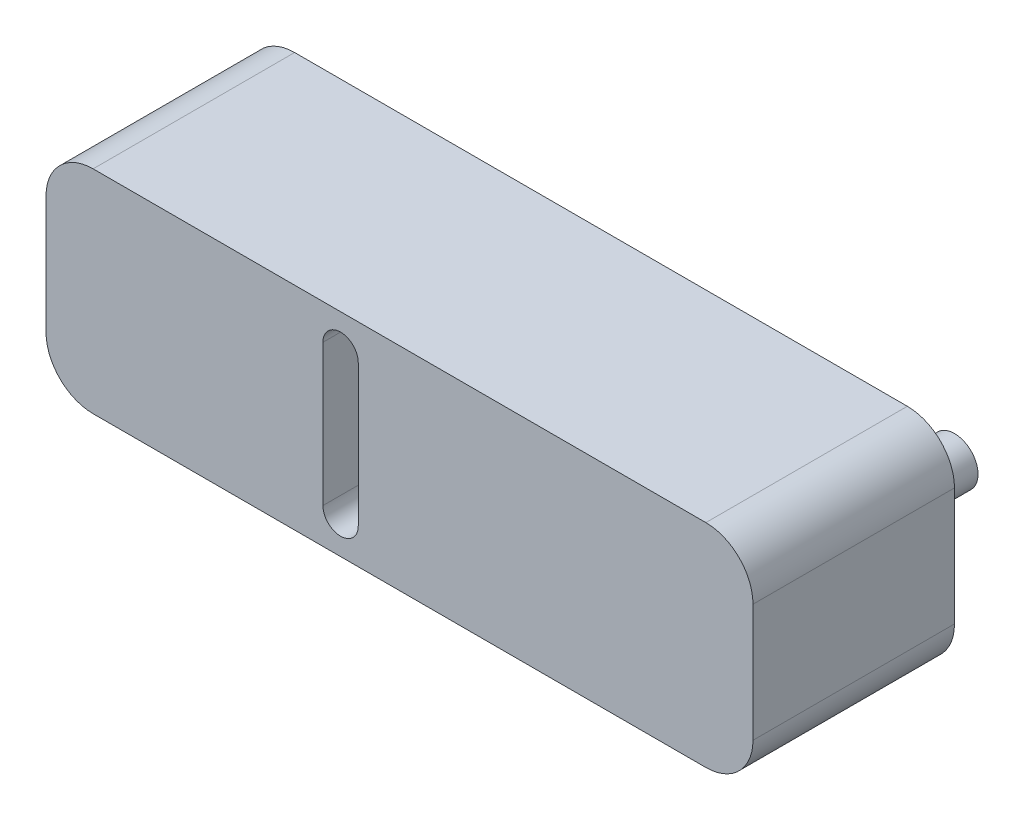
ISO-10303-21;
HEADER;
FILE_DESCRIPTION(('STEP AP214'),'2;1');
FILE_NAME('part.step','',(''),(''),'','','');
FILE_SCHEMA(('AUTOMOTIVE_DESIGN { 1 0 10303 214 1 1 1 1 }'));
ENDSEC;
DATA;
#1=APPLICATION_CONTEXT('core data for automotive mechanical design processes');
#2=APPLICATION_PROTOCOL_DEFINITION('international standard','automotive_design',2000,#1);
#3=PRODUCT_CONTEXT('',#1,'mechanical');
#4=PRODUCT('Part','Part','',(#3));
#5=PRODUCT_RELATED_PRODUCT_CATEGORY('part','',(#4));
#6=PRODUCT_DEFINITION_FORMATION('','',#4);
#7=PRODUCT_DEFINITION_CONTEXT('part definition',#1,'design');
#8=PRODUCT_DEFINITION('design','',#6,#7);
#9=PRODUCT_DEFINITION_SHAPE('','',#8);
#10=(LENGTH_UNIT() NAMED_UNIT(*) SI_UNIT(.MILLI.,.METRE.));
#11=(NAMED_UNIT(*) PLANE_ANGLE_UNIT() SI_UNIT($,.RADIAN.));
#12=(NAMED_UNIT(*) SI_UNIT($,.STERADIAN.) SOLID_ANGLE_UNIT());
#13=UNCERTAINTY_MEASURE_WITH_UNIT(LENGTH_MEASURE(1.E-05),#10,'distance_accuracy_value','');
#14=(GEOMETRIC_REPRESENTATION_CONTEXT(3) GLOBAL_UNCERTAINTY_ASSIGNED_CONTEXT((#13)) GLOBAL_UNIT_ASSIGNED_CONTEXT((#10,
#11,#12)) REPRESENTATION_CONTEXT('',''));
#15=CARTESIAN_POINT('',(0.,0.,0.));
#16=DIRECTION('',(0.,0.,1.));
#17=DIRECTION('',(1.,0.,0.));
#18=AXIS2_PLACEMENT_3D('',#15,#16,#17);
#19=CARTESIAN_POINT('',(38.1,-11.43,-21.717));
#20=DIRECTION('',(1.,0.,0.));
#21=DIRECTION('',(0.,0.,-1.));
#22=AXIS2_PLACEMENT_3D('',#19,#20,#21);
#23=PLANE('',#22);
#24=DIRECTION('',(0.,1.,0.));
#25=VECTOR('',#24,1.);
#26=CARTESIAN_POINT('',(38.1,-11.43,0.));
#27=LINE('',#26,#25);
#28=CARTESIAN_POINT('',(38.1,-6.35,0.));
#29=VERTEX_POINT('',#28);
#30=CARTESIAN_POINT('',(38.1,6.35,0.));
#31=VERTEX_POINT('',#30);
#32=EDGE_CURVE('E142',#29,#31,#27,.T.);
#33=ORIENTED_EDGE('',*,*,#32,.F.);
#34=DIRECTION('',(0.,0.,1.));
#35=VECTOR('',#34,1.);
#36=CARTESIAN_POINT('',(38.1,-6.35,-21.717));
#37=LINE('',#36,#35);
#38=CARTESIAN_POINT('',(38.1,-6.35,-21.717));
#39=VERTEX_POINT('',#38);
#40=EDGE_CURVE('E236',#29,#39,#37,.F.);
#41=ORIENTED_EDGE('',*,*,#40,.T.);
#42=DIRECTION('',(0.,1.,0.));
#43=VECTOR('',#42,1.);
#44=CARTESIAN_POINT('',(38.1,-11.43,-21.717));
#45=LINE('',#44,#43);
#46=CARTESIAN_POINT('',(38.1,6.35,-21.717));
#47=VERTEX_POINT('',#46);
#48=EDGE_CURVE('E183',#39,#47,#45,.T.);
#49=ORIENTED_EDGE('',*,*,#48,.T.);
#50=DIRECTION('',(0.,0.,1.));
#51=VECTOR('',#50,1.);
#52=CARTESIAN_POINT('',(38.1,6.35,-21.717));
#53=LINE('',#52,#51);
#54=EDGE_CURVE('E232',#47,#31,#53,.T.);
#55=ORIENTED_EDGE('',*,*,#54,.T.);
#56=EDGE_LOOP('',(#33,#41,#49,#55));
#57=FACE_BOUND('',#56,.T.);
#58=ADVANCED_FACE('F39',(#57),#23,.T.);
#59=CARTESIAN_POINT('',(-38.1,-11.43,-21.717));
#60=DIRECTION('',(0.,-1.,0.));
#61=DIRECTION('',(0.,0.,-1.));
#62=AXIS2_PLACEMENT_3D('',#59,#60,#61);
#63=PLANE('',#62);
#64=DIRECTION('',(1.,0.,0.));
#65=VECTOR('',#64,1.);
#66=CARTESIAN_POINT('',(-38.1,-11.43,-21.717));
#67=LINE('',#66,#65);
#68=CARTESIAN_POINT('',(-33.02,-11.43,-21.717));
#69=VERTEX_POINT('',#68);
#70=CARTESIAN_POINT('',(33.02,-11.43,-21.717));
#71=VERTEX_POINT('',#70);
#72=EDGE_CURVE('E195',#69,#71,#67,.T.);
#73=ORIENTED_EDGE('',*,*,#72,.T.);
#74=DIRECTION('',(0.,0.,1.));
#75=VECTOR('',#74,1.);
#76=CARTESIAN_POINT('',(33.02,-11.43,-21.717));
#77=LINE('',#76,#75);
#78=CARTESIAN_POINT('',(33.02,-11.43,0.));
#79=VERTEX_POINT('',#78);
#80=EDGE_CURVE('E216',#71,#79,#77,.T.);
#81=ORIENTED_EDGE('',*,*,#80,.T.);
#82=DIRECTION('',(1.,0.,0.));
#83=VECTOR('',#82,1.);
#84=CARTESIAN_POINT('',(-38.1,-11.43,0.));
#85=LINE('',#84,#83);
#86=CARTESIAN_POINT('',(-33.02,-11.43,0.));
#87=VERTEX_POINT('',#86);
#88=EDGE_CURVE('E188',#87,#79,#85,.T.);
#89=ORIENTED_EDGE('',*,*,#88,.F.);
#90=DIRECTION('',(0.,0.,1.));
#91=VECTOR('',#90,1.);
#92=CARTESIAN_POINT('',(-33.02,-11.43,-21.717));
#93=LINE('',#92,#91);
#94=EDGE_CURVE('E199',#87,#69,#93,.F.);
#95=ORIENTED_EDGE('',*,*,#94,.T.);
#96=EDGE_LOOP('',(#73,#81,#89,#95));
#97=FACE_BOUND('',#96,.T.);
#98=ADVANCED_FACE('F283',(#97),#63,.T.);
#99=CARTESIAN_POINT('',(-38.1,-11.43,-21.717));
#100=DIRECTION('',(-1.,0.,0.));
#101=DIRECTION('',(0.,0.,1.));
#102=AXIS2_PLACEMENT_3D('',#99,#100,#101);
#103=PLANE('',#102);
#104=DIRECTION('',(0.,-1.,0.));
#105=VECTOR('',#104,1.);
#106=CARTESIAN_POINT('',(-38.1,-11.43,-21.717));
#107=LINE('',#106,#105);
#108=CARTESIAN_POINT('',(-38.1,6.35,-21.717));
#109=VERTEX_POINT('',#108);
#110=CARTESIAN_POINT('',(-38.1,-6.35,-21.717));
#111=VERTEX_POINT('',#110);
#112=EDGE_CURVE('E191',#109,#111,#107,.T.);
#113=ORIENTED_EDGE('',*,*,#112,.T.);
#114=DIRECTION('',(0.,0.,1.));
#115=VECTOR('',#114,1.);
#116=CARTESIAN_POINT('',(-38.1,-6.35,-21.717));
#117=LINE('',#116,#115);
#118=CARTESIAN_POINT('',(-38.1,-6.35,0.));
#119=VERTEX_POINT('',#118);
#120=EDGE_CURVE('E253',#111,#119,#117,.T.);
#121=ORIENTED_EDGE('',*,*,#120,.T.);
#122=DIRECTION('',(0.,-1.,0.));
#123=VECTOR('',#122,1.);
#124=CARTESIAN_POINT('',(-38.1,-11.43,0.));
#125=LINE('',#124,#123);
#126=CARTESIAN_POINT('',(-38.1,6.35,0.));
#127=VERTEX_POINT('',#126);
#128=EDGE_CURVE('E207',#127,#119,#125,.T.);
#129=ORIENTED_EDGE('',*,*,#128,.F.);
#130=DIRECTION('',(0.,0.,1.));
#131=VECTOR('',#130,1.);
#132=CARTESIAN_POINT('',(-38.1,6.35,-21.717));
#133=LINE('',#132,#131);
#134=EDGE_CURVE('E250',#127,#109,#133,.F.);
#135=ORIENTED_EDGE('',*,*,#134,.T.);
#136=EDGE_LOOP('',(#113,#121,#129,#135));
#137=FACE_BOUND('',#136,.T.);
#138=ADVANCED_FACE('F260',(#137),#103,.T.);
#139=CARTESIAN_POINT('',(-38.1,11.43,-21.717));
#140=DIRECTION('',(0.,1.,0.));
#141=DIRECTION('',(0.,0.,1.));
#142=AXIS2_PLACEMENT_3D('',#139,#140,#141);
#143=PLANE('',#142);
#144=DIRECTION('',(-1.,0.,0.));
#145=VECTOR('',#144,1.);
#146=CARTESIAN_POINT('',(-38.1,11.43,-21.717));
#147=LINE('',#146,#145);
#148=CARTESIAN_POINT('',(33.02,11.43,-21.717));
#149=VERTEX_POINT('',#148);
#150=CARTESIAN_POINT('',(-33.02,11.43,-21.717));
#151=VERTEX_POINT('',#150);
#152=EDGE_CURVE('E187',#149,#151,#147,.T.);
#153=ORIENTED_EDGE('',*,*,#152,.T.);
#154=DIRECTION('',(0.,0.,1.));
#155=VECTOR('',#154,1.);
#156=CARTESIAN_POINT('',(-33.02,11.43,-21.717));
#157=LINE('',#156,#155);
#158=CARTESIAN_POINT('',(-33.02,11.43,0.));
#159=VERTEX_POINT('',#158);
#160=EDGE_CURVE('E11',#151,#159,#157,.T.);
#161=ORIENTED_EDGE('',*,*,#160,.T.);
#162=DIRECTION('',(-1.,0.,0.));
#163=VECTOR('',#162,1.);
#164=CARTESIAN_POINT('',(-38.1,11.43,0.));
#165=LINE('',#164,#163);
#166=CARTESIAN_POINT('',(33.02,11.43,0.));
#167=VERTEX_POINT('',#166);
#168=EDGE_CURVE('E203',#167,#159,#165,.T.);
#169=ORIENTED_EDGE('',*,*,#168,.F.);
#170=DIRECTION('',(0.,0.,1.));
#171=VECTOR('',#170,1.);
#172=CARTESIAN_POINT('',(33.02,11.43,-21.717));
#173=LINE('',#172,#171);
#174=EDGE_CURVE('E48',#167,#149,#173,.F.);
#175=ORIENTED_EDGE('',*,*,#174,.T.);
#176=EDGE_LOOP('',(#153,#161,#169,#175));
#177=FACE_BOUND('',#176,.T.);
#178=ADVANCED_FACE('F270',(#177),#143,.T.);
#179=CARTESIAN_POINT('',(0.,0.,-21.717));
#180=DIRECTION('',(0.,0.,-1.));
#181=DIRECTION('',(-1.,0.,0.));
#182=AXIS2_PLACEMENT_3D('',#179,#180,#181);
#183=PLANE('',#182);
#184=CARTESIAN_POINT('',(29.21,0.,-21.717));
#185=DIRECTION('',(0.,0.,-1.));
#186=DIRECTION('',(-1.,0.,0.));
#187=AXIS2_PLACEMENT_3D('',#184,#185,#186);
#188=CIRCLE('',#187,2.54);
#189=CARTESIAN_POINT('',(26.67,0.,-21.717));
#190=VERTEX_POINT('',#189);
#191=EDGE_CURVE('E336',#190,#190,#188,.T.);
#192=ORIENTED_EDGE('',*,*,#191,.F.);
#193=EDGE_LOOP('',(#192));
#194=FACE_BOUND('',#193,.T.);
#195=CARTESIAN_POINT('',(-6.35,-7.62,-21.717));
#196=DIRECTION('',(0.,0.,-1.));
#197=DIRECTION('',(-1.,0.,0.));
#198=AXIS2_PLACEMENT_3D('',#195,#196,#197);
#199=CIRCLE('',#198,1.905);
#200=CARTESIAN_POINT('',(-8.255,-7.62,-21.717));
#201=VERTEX_POINT('',#200);
#202=CARTESIAN_POINT('',(-4.445,-7.62,-21.717));
#203=VERTEX_POINT('',#202);
#204=EDGE_CURVE('E147',#201,#203,#199,.F.);
#205=ORIENTED_EDGE('',*,*,#204,.T.);
#206=DIRECTION('',(0.,1.,0.));
#207=VECTOR('',#206,1.);
#208=CARTESIAN_POINT('',(-4.445,-7.62,-21.717));
#209=LINE('',#208,#207);
#210=CARTESIAN_POINT('',(-4.44500000000001,7.62,-21.717));
#211=VERTEX_POINT('',#210);
#212=EDGE_CURVE('E130',#203,#211,#209,.T.);
#213=ORIENTED_EDGE('',*,*,#212,.T.);
#214=CARTESIAN_POINT('',(-6.35,7.62,-21.717));
#215=DIRECTION('',(0.,0.,-1.));
#216=DIRECTION('',(-1.,0.,0.));
#217=AXIS2_PLACEMENT_3D('',#214,#215,#216);
#218=CIRCLE('',#217,1.905);
#219=CARTESIAN_POINT('',(-8.255,7.62,-21.717));
#220=VERTEX_POINT('',#219);
#221=EDGE_CURVE('E163',#211,#220,#218,.F.);
#222=ORIENTED_EDGE('',*,*,#221,.T.);
#223=DIRECTION('',(0.,-1.,0.));
#224=VECTOR('',#223,1.);
#225=CARTESIAN_POINT('',(-8.255,-7.62,-21.717));
#226=LINE('',#225,#224);
#227=EDGE_CURVE('E156',#220,#201,#226,.T.);
#228=ORIENTED_EDGE('',*,*,#227,.T.);
#229=EDGE_LOOP('',(#205,#213,#222,#228));
#230=FACE_BOUND('',#229,.T.);
#231=ORIENTED_EDGE('',*,*,#48,.F.);
#232=CARTESIAN_POINT('',(33.02,-6.35,-21.717));
#233=DIRECTION('',(0.,0.,-1.));
#234=DIRECTION('',(-1.,0.,0.));
#235=AXIS2_PLACEMENT_3D('',#232,#233,#234);
#236=CIRCLE('',#235,5.08);
#237=EDGE_CURVE('E247',#39,#71,#236,.T.);
#238=ORIENTED_EDGE('',*,*,#237,.T.);
#239=ORIENTED_EDGE('',*,*,#72,.F.);
#240=CARTESIAN_POINT('',(-33.02,-6.35,-21.717));
#241=DIRECTION('',(0.,0.,-1.));
#242=DIRECTION('',(-1.,0.,0.));
#243=AXIS2_PLACEMENT_3D('',#240,#241,#242);
#244=CIRCLE('',#243,5.08);
#245=EDGE_CURVE('E244',#69,#111,#244,.T.);
#246=ORIENTED_EDGE('',*,*,#245,.T.);
#247=ORIENTED_EDGE('',*,*,#112,.F.);
#248=CARTESIAN_POINT('',(-33.02,6.35,-21.717));
#249=DIRECTION('',(0.,0.,-1.));
#250=DIRECTION('',(-1.,0.,0.));
#251=AXIS2_PLACEMENT_3D('',#248,#249,#250);
#252=CIRCLE('',#251,5.08);
#253=EDGE_CURVE('E55',#109,#151,#252,.T.);
#254=ORIENTED_EDGE('',*,*,#253,.T.);
#255=ORIENTED_EDGE('',*,*,#152,.F.);
#256=CARTESIAN_POINT('',(33.02,6.35,-21.717));
#257=DIRECTION('',(0.,0.,-1.));
#258=DIRECTION('',(-1.,0.,0.));
#259=AXIS2_PLACEMENT_3D('',#256,#257,#258);
#260=CIRCLE('',#259,5.08);
#261=EDGE_CURVE('E239',#149,#47,#260,.T.);
#262=ORIENTED_EDGE('',*,*,#261,.T.);
#263=EDGE_LOOP('',(#231,#238,#239,#246,#247,#254,#255,#262));
#264=FACE_BOUND('',#263,.T.);
#265=ADVANCED_FACE('F155',(#194,#230,#264),#183,.T.);
#266=CARTESIAN_POINT('',(0.,0.,0.));
#267=DIRECTION('',(0.,0.,-1.));
#268=DIRECTION('',(-1.,0.,0.));
#269=AXIS2_PLACEMENT_3D('',#266,#267,#268);
#270=PLANE('',#269);
#271=DIRECTION('',(0.,1.,0.));
#272=VECTOR('',#271,1.);
#273=CARTESIAN_POINT('',(-4.445,-7.62,0.));
#274=LINE('',#273,#272);
#275=CARTESIAN_POINT('',(-4.445,-7.62,0.));
#276=VERTEX_POINT('',#275);
#277=CARTESIAN_POINT('',(-4.44500000000001,7.62,0.));
#278=VERTEX_POINT('',#277);
#279=EDGE_CURVE('E161',#276,#278,#274,.T.);
#280=ORIENTED_EDGE('',*,*,#279,.F.);
#281=CARTESIAN_POINT('',(-6.35,-7.62,0.));
#282=DIRECTION('',(0.,0.,1.));
#283=DIRECTION('',(1.,0.,0.));
#284=AXIS2_PLACEMENT_3D('',#281,#282,#283);
#285=CIRCLE('',#284,1.905);
#286=CARTESIAN_POINT('',(-8.255,-7.62,0.));
#287=VERTEX_POINT('',#286);
#288=EDGE_CURVE('E150',#287,#276,#285,.T.);
#289=ORIENTED_EDGE('',*,*,#288,.F.);
#290=DIRECTION('',(0.,-1.,0.));
#291=VECTOR('',#290,1.);
#292=CARTESIAN_POINT('',(-8.255,-7.62,0.));
#293=LINE('',#292,#291);
#294=CARTESIAN_POINT('',(-8.255,7.62,0.));
#295=VERTEX_POINT('',#294);
#296=EDGE_CURVE('E152',#295,#287,#293,.T.);
#297=ORIENTED_EDGE('',*,*,#296,.F.);
#298=CARTESIAN_POINT('',(-6.35,7.62,0.));
#299=DIRECTION('',(0.,0.,1.));
#300=DIRECTION('',(1.,0.,0.));
#301=AXIS2_PLACEMENT_3D('',#298,#299,#300);
#302=CIRCLE('',#301,1.905);
#303=EDGE_CURVE('E169',#278,#295,#302,.T.);
#304=ORIENTED_EDGE('',*,*,#303,.F.);
#305=EDGE_LOOP('',(#280,#289,#297,#304));
#306=FACE_BOUND('',#305,.T.);
#307=ORIENTED_EDGE('',*,*,#88,.T.);
#308=CARTESIAN_POINT('',(33.02,-6.35,0.));
#309=DIRECTION('',(0.,0.,-1.));
#310=DIRECTION('',(-1.,0.,0.));
#311=AXIS2_PLACEMENT_3D('',#308,#309,#310);
#312=CIRCLE('',#311,5.08);
#313=EDGE_CURVE('E229',#79,#29,#312,.F.);
#314=ORIENTED_EDGE('',*,*,#313,.T.);
#315=ORIENTED_EDGE('',*,*,#32,.T.);
#316=CARTESIAN_POINT('',(33.02,6.35,0.));
#317=DIRECTION('',(0.,0.,-1.));
#318=DIRECTION('',(-1.,0.,0.));
#319=AXIS2_PLACEMENT_3D('',#316,#317,#318);
#320=CIRCLE('',#319,5.08);
#321=EDGE_CURVE('E220',#31,#167,#320,.F.);
#322=ORIENTED_EDGE('',*,*,#321,.T.);
#323=ORIENTED_EDGE('',*,*,#168,.T.);
#324=CARTESIAN_POINT('',(-33.02,6.35,0.));
#325=DIRECTION('',(0.,0.,-1.));
#326=DIRECTION('',(-1.,0.,0.));
#327=AXIS2_PLACEMENT_3D('',#324,#325,#326);
#328=CIRCLE('',#327,5.08);
#329=EDGE_CURVE('E223',#159,#127,#328,.F.);
#330=ORIENTED_EDGE('',*,*,#329,.T.);
#331=ORIENTED_EDGE('',*,*,#128,.T.);
#332=CARTESIAN_POINT('',(-33.02,-6.35,0.));
#333=DIRECTION('',(0.,0.,-1.));
#334=DIRECTION('',(-1.,0.,0.));
#335=AXIS2_PLACEMENT_3D('',#332,#333,#334);
#336=CIRCLE('',#335,5.08);
#337=EDGE_CURVE('E226',#119,#87,#336,.F.);
#338=ORIENTED_EDGE('',*,*,#337,.T.);
#339=EDGE_LOOP('',(#307,#314,#315,#322,#323,#330,#331,#338));
#340=FACE_BOUND('',#339,.T.);
#341=ADVANCED_FACE('F265',(#306,#340),#270,.F.);
#342=CARTESIAN_POINT('',(-6.35,-7.62,-21.718));
#343=DIRECTION('',(0.,0.,1.));
#344=DIRECTION('',(1.,0.,0.));
#345=AXIS2_PLACEMENT_3D('',#342,#343,#344);
#346=CYLINDRICAL_SURFACE('',#345,1.905);
#347=DIRECTION('',(0.,0.,1.));
#348=VECTOR('',#347,1.);
#349=CARTESIAN_POINT('',(-8.255,-7.62,-21.718));
#350=LINE('',#349,#348);
#351=EDGE_CURVE('E143',#201,#287,#350,.T.);
#352=ORIENTED_EDGE('',*,*,#351,.T.);
#353=ORIENTED_EDGE('',*,*,#288,.T.);
#354=DIRECTION('',(0.,0.,1.));
#355=VECTOR('',#354,1.);
#356=CARTESIAN_POINT('',(-4.445,-7.62,-21.718));
#357=LINE('',#356,#355);
#358=EDGE_CURVE('E134',#203,#276,#357,.T.);
#359=ORIENTED_EDGE('',*,*,#358,.F.);
#360=ORIENTED_EDGE('',*,*,#204,.F.);
#361=EDGE_LOOP('',(#352,#353,#359,#360));
#362=FACE_BOUND('',#361,.T.);
#363=ADVANCED_FACE('F146',(#362),#346,.F.);
#364=CARTESIAN_POINT('',(-8.255,-7.62,-21.718));
#365=DIRECTION('',(-1.,0.,0.));
#366=DIRECTION('',(0.,-1.,0.));
#367=AXIS2_PLACEMENT_3D('',#364,#365,#366);
#368=PLANE('',#367);
#369=DIRECTION('',(0.,0.,1.));
#370=VECTOR('',#369,1.);
#371=CARTESIAN_POINT('',(-8.255,7.62,-21.718));
#372=LINE('',#371,#370);
#373=EDGE_CURVE('E178',#220,#295,#372,.T.);
#374=ORIENTED_EDGE('',*,*,#373,.T.);
#375=ORIENTED_EDGE('',*,*,#296,.T.);
#376=ORIENTED_EDGE('',*,*,#351,.F.);
#377=ORIENTED_EDGE('',*,*,#227,.F.);
#378=EDGE_LOOP('',(#374,#375,#376,#377));
#379=FACE_BOUND('',#378,.T.);
#380=ADVANCED_FACE('F313',(#379),#368,.F.);
#381=CARTESIAN_POINT('',(-6.35,7.62,-21.718));
#382=DIRECTION('',(0.,0.,1.));
#383=DIRECTION('',(1.,0.,0.));
#384=AXIS2_PLACEMENT_3D('',#381,#382,#383);
#385=CYLINDRICAL_SURFACE('',#384,1.905);
#386=DIRECTION('',(0.,0.,1.));
#387=VECTOR('',#386,1.);
#388=CARTESIAN_POINT('',(-4.44500000000001,7.62,-21.718));
#389=LINE('',#388,#387);
#390=EDGE_CURVE('E136',#211,#278,#389,.T.);
#391=ORIENTED_EDGE('',*,*,#390,.T.);
#392=ORIENTED_EDGE('',*,*,#303,.T.);
#393=ORIENTED_EDGE('',*,*,#373,.F.);
#394=ORIENTED_EDGE('',*,*,#221,.F.);
#395=EDGE_LOOP('',(#391,#392,#393,#394));
#396=FACE_BOUND('',#395,.T.);
#397=ADVANCED_FACE('F316',(#396),#385,.F.);
#398=CARTESIAN_POINT('',(-4.445,-7.62,-21.718));
#399=DIRECTION('',(1.,0.,0.));
#400=DIRECTION('',(0.,1.,0.));
#401=AXIS2_PLACEMENT_3D('',#398,#399,#400);
#402=PLANE('',#401);
#403=ORIENTED_EDGE('',*,*,#358,.T.);
#404=ORIENTED_EDGE('',*,*,#279,.T.);
#405=ORIENTED_EDGE('',*,*,#390,.F.);
#406=ORIENTED_EDGE('',*,*,#212,.F.);
#407=EDGE_LOOP('',(#403,#404,#405,#406));
#408=FACE_BOUND('',#407,.T.);
#409=ADVANCED_FACE('F132',(#408),#402,.F.);
#410=CARTESIAN_POINT('',(33.02,-6.35,-21.717));
#411=DIRECTION('',(0.,0.,1.));
#412=DIRECTION('',(1.,0.,0.));
#413=AXIS2_PLACEMENT_3D('',#410,#411,#412);
#414=CYLINDRICAL_SURFACE('',#413,5.08);
#415=ORIENTED_EDGE('',*,*,#237,.F.);
#416=ORIENTED_EDGE('',*,*,#40,.F.);
#417=ORIENTED_EDGE('',*,*,#313,.F.);
#418=ORIENTED_EDGE('',*,*,#80,.F.);
#419=EDGE_LOOP('',(#415,#416,#417,#418));
#420=FACE_BOUND('',#419,.T.);
#421=ADVANCED_FACE('F281',(#420),#414,.T.);
#422=CARTESIAN_POINT('',(-33.02,-6.35,-21.717));
#423=DIRECTION('',(0.,0.,1.));
#424=DIRECTION('',(1.,0.,0.));
#425=AXIS2_PLACEMENT_3D('',#422,#423,#424);
#426=CYLINDRICAL_SURFACE('',#425,5.08);
#427=ORIENTED_EDGE('',*,*,#245,.F.);
#428=ORIENTED_EDGE('',*,*,#94,.F.);
#429=ORIENTED_EDGE('',*,*,#337,.F.);
#430=ORIENTED_EDGE('',*,*,#120,.F.);
#431=EDGE_LOOP('',(#427,#428,#429,#430));
#432=FACE_BOUND('',#431,.T.);
#433=ADVANCED_FACE('F286',(#432),#426,.T.);
#434=CARTESIAN_POINT('',(-33.02,6.35,-21.717));
#435=DIRECTION('',(0.,0.,1.));
#436=DIRECTION('',(1.,0.,0.));
#437=AXIS2_PLACEMENT_3D('',#434,#435,#436);
#438=CYLINDRICAL_SURFACE('',#437,5.08);
#439=ORIENTED_EDGE('',*,*,#253,.F.);
#440=ORIENTED_EDGE('',*,*,#134,.F.);
#441=ORIENTED_EDGE('',*,*,#329,.F.);
#442=ORIENTED_EDGE('',*,*,#160,.F.);
#443=EDGE_LOOP('',(#439,#440,#441,#442));
#444=FACE_BOUND('',#443,.T.);
#445=ADVANCED_FACE('F269',(#444),#438,.T.);
#446=CARTESIAN_POINT('',(33.02,6.35,-21.717));
#447=DIRECTION('',(0.,0.,1.));
#448=DIRECTION('',(1.,0.,0.));
#449=AXIS2_PLACEMENT_3D('',#446,#447,#448);
#450=CYLINDRICAL_SURFACE('',#449,5.08);
#451=ORIENTED_EDGE('',*,*,#261,.F.);
#452=ORIENTED_EDGE('',*,*,#174,.F.);
#453=ORIENTED_EDGE('',*,*,#321,.F.);
#454=ORIENTED_EDGE('',*,*,#54,.F.);
#455=EDGE_LOOP('',(#451,#452,#453,#454));
#456=FACE_BOUND('',#455,.T.);
#457=ADVANCED_FACE('F41',(#456),#450,.T.);
#458=CARTESIAN_POINT('',(29.21,0.,-30.607));
#459=DIRECTION('',(0.,0.,1.));
#460=DIRECTION('',(1.,0.,0.));
#461=AXIS2_PLACEMENT_3D('',#458,#459,#460);
#462=CYLINDRICAL_SURFACE('',#461,2.54);
#463=CARTESIAN_POINT('',(29.21,0.,-30.607));
#464=DIRECTION('',(0.,0.,-1.));
#465=DIRECTION('',(-1.,0.,0.));
#466=AXIS2_PLACEMENT_3D('',#463,#464,#465);
#467=CIRCLE('',#466,2.54);
#468=CARTESIAN_POINT('',(26.67,0.,-30.607));
#469=VERTEX_POINT('',#468);
#470=EDGE_CURVE('E334',#469,#469,#467,.T.);
#471=ORIENTED_EDGE('',*,*,#470,.F.);
#472=EDGE_LOOP('',(#471));
#473=FACE_BOUND('',#472,.T.);
#474=ORIENTED_EDGE('',*,*,#191,.T.);
#475=EDGE_LOOP('',(#474));
#476=FACE_BOUND('',#475,.T.);
#477=ADVANCED_FACE('F323',(#473,#476),#462,.T.);
#478=CARTESIAN_POINT('',(29.21,0.,-30.607));
#479=DIRECTION('',(0.,0.,-1.));
#480=DIRECTION('',(-1.,0.,0.));
#481=AXIS2_PLACEMENT_3D('',#478,#479,#480);
#482=PLANE('',#481);
#483=ORIENTED_EDGE('',*,*,#470,.T.);
#484=EDGE_LOOP('',(#483));
#485=FACE_BOUND('',#484,.T.);
#486=ADVANCED_FACE('F326',(#485),#482,.T.);
#487=CLOSED_SHELL('',(#58,#98,#138,#178,#265,#341,#363,#380,#397,#409,#421,#433,#445,#457,#477,#486));
#488=MANIFOLD_SOLID_BREP('B2',#487);
#489=ADVANCED_BREP_SHAPE_REPRESENTATION('',(#18,#488),#14);
#490=SHAPE_DEFINITION_REPRESENTATION(#9,#489);
ENDSEC;
END-ISO-10303-21;
